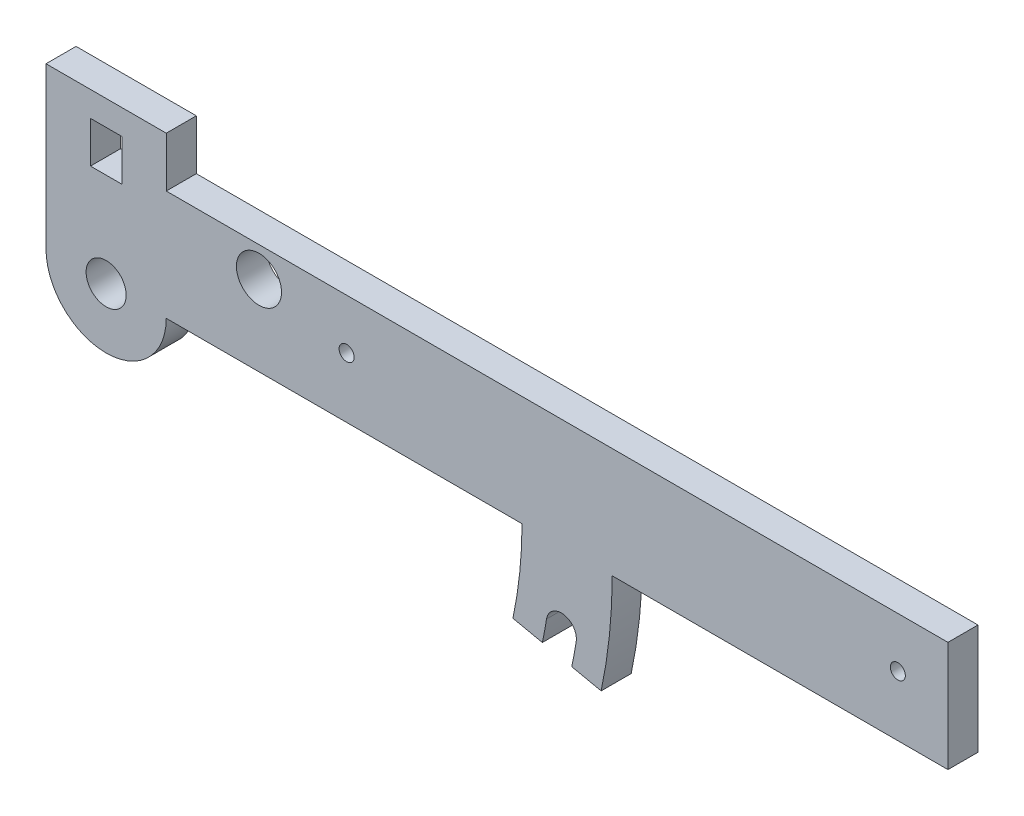
ISO-10303-21;
HEADER;
FILE_DESCRIPTION(('STEP AP214'),'2;1');
FILE_NAME('part.step','',(''),(''),'','','');
FILE_SCHEMA(('AUTOMOTIVE_DESIGN { 1 0 10303 214 1 1 1 1 }'));
ENDSEC;
DATA;
#1=APPLICATION_CONTEXT('core data for automotive mechanical design processes');
#2=APPLICATION_PROTOCOL_DEFINITION('international standard','automotive_design',2000,#1);
#3=PRODUCT_CONTEXT('',#1,'mechanical');
#4=PRODUCT('Part','Part','',(#3));
#5=PRODUCT_RELATED_PRODUCT_CATEGORY('part','',(#4));
#6=PRODUCT_DEFINITION_FORMATION('','',#4);
#7=PRODUCT_DEFINITION_CONTEXT('part definition',#1,'design');
#8=PRODUCT_DEFINITION('design','',#6,#7);
#9=PRODUCT_DEFINITION_SHAPE('','',#8);
#10=(LENGTH_UNIT() NAMED_UNIT(*) SI_UNIT(.MILLI.,.METRE.));
#11=(NAMED_UNIT(*) PLANE_ANGLE_UNIT() SI_UNIT($,.RADIAN.));
#12=(NAMED_UNIT(*) SI_UNIT($,.STERADIAN.) SOLID_ANGLE_UNIT());
#13=UNCERTAINTY_MEASURE_WITH_UNIT(LENGTH_MEASURE(1.E-05),#10,'distance_accuracy_value','');
#14=(GEOMETRIC_REPRESENTATION_CONTEXT(3) GLOBAL_UNCERTAINTY_ASSIGNED_CONTEXT((#13)) GLOBAL_UNIT_ASSIGNED_CONTEXT((#10,
#11,#12)) REPRESENTATION_CONTEXT('',''));
#15=CARTESIAN_POINT('',(0.,0.,0.));
#16=DIRECTION('',(0.,0.,1.));
#17=DIRECTION('',(1.,0.,0.));
#18=AXIS2_PLACEMENT_3D('',#15,#16,#17);
#19=CARTESIAN_POINT('',(-118.,-7.,6.));
#20=DIRECTION('',(0.,0.,1.));
#21=DIRECTION('',(1.,0.,0.));
#22=AXIS2_PLACEMENT_3D('',#19,#20,#21);
#23=PLANE('',#22);
#24=CARTESIAN_POINT('',(40.,5.,6.));
#25=DIRECTION('',(0.,0.,1.));
#26=DIRECTION('',(-1.,0.,0.));
#27=AXIS2_PLACEMENT_3D('',#24,#25,#26);
#28=CIRCLE('',#27,1.50000000000002);
#29=CARTESIAN_POINT('',(38.5,5.,6.));
#30=VERTEX_POINT('',#29);
#31=EDGE_CURVE('E193',#30,#30,#28,.T.);
#32=ORIENTED_EDGE('',*,*,#31,.F.);
#33=EDGE_LOOP('',(#32));
#34=FACE_BOUND('',#33,.T.);
#35=CARTESIAN_POINT('',(-118.,-7.,6.));
#36=DIRECTION('',(0.,0.,1.));
#37=DIRECTION('',(1.,0.,0.));
#38=AXIS2_PLACEMENT_3D('',#35,#36,#37);
#39=CIRCLE('',#38,4.00000000000001);
#40=CARTESIAN_POINT('',(-114.,-7.,6.));
#41=VERTEX_POINT('',#40);
#42=EDGE_CURVE('E209',#41,#41,#39,.T.);
#43=ORIENTED_EDGE('',*,*,#42,.F.);
#44=EDGE_LOOP('',(#43));
#45=FACE_BOUND('',#44,.T.);
#46=DIRECTION('',(-1.,0.,0.));
#47=VECTOR('',#46,1.);
#48=CARTESIAN_POINT('',(50.,15.,6.));
#49=LINE('',#48,#47);
#50=CARTESIAN_POINT('',(50.,15.,6.));
#51=VERTEX_POINT('',#50);
#52=CARTESIAN_POINT('',(-106.,15.,6.));
#53=VERTEX_POINT('',#52);
#54=EDGE_CURVE('E215',#51,#53,#49,.T.);
#55=ORIENTED_EDGE('',*,*,#54,.T.);
#56=DIRECTION('',(0.,1.,0.));
#57=VECTOR('',#56,1.);
#58=CARTESIAN_POINT('',(-106.,15.,6.));
#59=LINE('',#58,#57);
#60=CARTESIAN_POINT('',(-106.,25.,6.));
#61=VERTEX_POINT('',#60);
#62=EDGE_CURVE('E218',#53,#61,#59,.T.);
#63=ORIENTED_EDGE('',*,*,#62,.T.);
#64=DIRECTION('',(-1.,0.,0.));
#65=VECTOR('',#64,1.);
#66=CARTESIAN_POINT('',(-106.,25.,6.));
#67=LINE('',#66,#65);
#68=CARTESIAN_POINT('',(-130.,25.,6.));
#69=VERTEX_POINT('',#68);
#70=EDGE_CURVE('E221',#61,#69,#67,.T.);
#71=ORIENTED_EDGE('',*,*,#70,.T.);
#72=DIRECTION('',(0.,-1.,0.));
#73=VECTOR('',#72,1.);
#74=CARTESIAN_POINT('',(-130.,25.,6.));
#75=LINE('',#74,#73);
#76=CARTESIAN_POINT('',(-130.,-7.,6.));
#77=VERTEX_POINT('',#76);
#78=EDGE_CURVE('E223',#69,#77,#75,.T.);
#79=ORIENTED_EDGE('',*,*,#78,.T.);
#80=CARTESIAN_POINT('',(-118.,-7.,6.));
#81=DIRECTION('',(0.,0.,1.));
#82=DIRECTION('',(1.,0.,0.));
#83=AXIS2_PLACEMENT_3D('',#80,#81,#82);
#84=CIRCLE('',#83,12.);
#85=CARTESIAN_POINT('',(-106.,-7.,6.));
#86=VERTEX_POINT('',#85);
#87=EDGE_CURVE('E225',#77,#86,#84,.T.);
#88=ORIENTED_EDGE('',*,*,#87,.T.);
#89=DIRECTION('',(1.,0.,0.));
#90=VECTOR('',#89,1.);
#91=CARTESIAN_POINT('',(-106.,-7.,6.));
#92=LINE('',#91,#90);
#93=CARTESIAN_POINT('',(-35.,-6.99999999999999,6.));
#94=VERTEX_POINT('',#93);
#95=EDGE_CURVE('E227',#86,#94,#92,.T.);
#96=ORIENTED_EDGE('',*,*,#95,.T.);
#97=CARTESIAN_POINT('',(-118.,-7.,6.));
#98=DIRECTION('',(0.,0.,-1.));
#99=DIRECTION('',(-1.,0.,0.));
#100=AXIS2_PLACEMENT_3D('',#97,#98,#99);
#101=CIRCLE('',#100,83.);
#102=CARTESIAN_POINT('',(-36.8137491390941,-24.2566703378741,6.));
#103=VERTEX_POINT('',#102);
#104=EDGE_CURVE('E229',#94,#103,#101,.T.);
#105=ORIENTED_EDGE('',*,*,#104,.T.);
#106=DIRECTION('',(0.978147600733805,-0.20791169081776,0.));
#107=VECTOR('',#106,1.);
#108=CARTESIAN_POINT('',(-36.8137491390941,-24.2566703378741,6.));
#109=LINE('',#108,#107);
#110=CARTESIAN_POINT('',(-30.9448635346913,-25.5041404827806,6.));
#111=VERTEX_POINT('',#110);
#112=EDGE_CURVE('E231',#103,#111,#109,.T.);
#113=ORIENTED_EDGE('',*,*,#112,.T.);
#114=CARTESIAN_POINT('',(-118.,-7.,6.));
#115=DIRECTION('',(0.,0.,1.));
#116=DIRECTION('',(-1.,0.,0.));
#117=AXIS2_PLACEMENT_3D('',#114,#115,#116);
#118=CIRCLE('',#117,89.);
#119=CARTESIAN_POINT('',(-30.1123535870187,-21.0271739130435,6.));
#120=VERTEX_POINT('',#119);
#121=EDGE_CURVE('E233',#111,#120,#118,.T.);
#122=ORIENTED_EDGE('',*,*,#121,.T.);
#123=CARTESIAN_POINT('',(-27.1498486517496,-21.5,6.));
#124=DIRECTION('',(0.,0.,-1.));
#125=DIRECTION('',(-1.,0.,0.));
#126=AXIS2_PLACEMENT_3D('',#123,#124,#125);
#127=CIRCLE('',#126,3.);
#128=CARTESIAN_POINT('',(-24.1873437164806,-21.9728260869565,6.));
#129=VERTEX_POINT('',#128);
#130=EDGE_CURVE('E235',#120,#129,#127,.T.);
#131=ORIENTED_EDGE('',*,*,#130,.T.);
#132=CARTESIAN_POINT('',(-118.,-7.,6.));
#133=DIRECTION('',(0.,0.,-1.));
#134=DIRECTION('',(-1.,0.,0.));
#135=AXIS2_PLACEMENT_3D('',#132,#133,#134);
#136=CIRCLE('',#135,95.);
#137=CARTESIAN_POINT('',(-25.0759779302885,-26.7516106276872,6.));
#138=VERTEX_POINT('',#137);
#139=EDGE_CURVE('E237',#129,#138,#136,.T.);
#140=ORIENTED_EDGE('',*,*,#139,.T.);
#141=DIRECTION('',(0.978147600733806,-0.20791169081776,0.));
#142=VECTOR('',#141,1.);
#143=CARTESIAN_POINT('',(-25.0759779302885,-26.7516106276872,6.));
#144=LINE('',#143,#142);
#145=CARTESIAN_POINT('',(-19.2070923258856,-27.9990807725938,6.));
#146=VERTEX_POINT('',#145);
#147=EDGE_CURVE('E239',#138,#146,#144,.T.);
#148=ORIENTED_EDGE('',*,*,#147,.T.);
#149=CARTESIAN_POINT('',(-118.,-7.,6.));
#150=DIRECTION('',(0.,0.,1.));
#151=DIRECTION('',(-1.,0.,0.));
#152=AXIS2_PLACEMENT_3D('',#149,#150,#151);
#153=CIRCLE('',#152,101.);
#154=CARTESIAN_POINT('',(-17.,-7.00000000000002,6.));
#155=VERTEX_POINT('',#154);
#156=EDGE_CURVE('E241',#146,#155,#153,.T.);
#157=ORIENTED_EDGE('',*,*,#156,.T.);
#158=DIRECTION('',(1.,0.,0.));
#159=VECTOR('',#158,1.);
#160=CARTESIAN_POINT('',(-17.,-7.00000000000002,6.));
#161=LINE('',#160,#159);
#162=CARTESIAN_POINT('',(50.,-7.,6.));
#163=VERTEX_POINT('',#162);
#164=EDGE_CURVE('E243',#155,#163,#161,.T.);
#165=ORIENTED_EDGE('',*,*,#164,.T.);
#166=DIRECTION('',(0.,1.,0.));
#167=VECTOR('',#166,1.);
#168=CARTESIAN_POINT('',(50.,-7.,6.));
#169=LINE('',#168,#167);
#170=EDGE_CURVE('E245',#163,#51,#169,.T.);
#171=ORIENTED_EDGE('',*,*,#170,.T.);
#172=EDGE_LOOP('',(#55,#63,#71,#79,#88,#96,#105,#113,#122,#131,#140,#148,#157,#165,#171));
#173=FACE_BOUND('',#172,.T.);
#174=CARTESIAN_POINT('',(-87.5,9.,6.));
#175=DIRECTION('',(0.,0.,1.));
#176=DIRECTION('',(1.,0.,0.));
#177=AXIS2_PLACEMENT_3D('',#174,#175,#176);
#178=CIRCLE('',#177,4.5);
#179=CARTESIAN_POINT('',(-83.,9.,6.));
#180=VERTEX_POINT('',#179);
#181=EDGE_CURVE('E203',#180,#180,#178,.T.);
#182=ORIENTED_EDGE('',*,*,#181,.F.);
#183=EDGE_LOOP('',(#182));
#184=FACE_BOUND('',#183,.T.);
#185=DIRECTION('',(1.,0.,0.));
#186=VECTOR('',#185,1.);
#187=CARTESIAN_POINT('',(-121.125,11.75,6.));
#188=LINE('',#187,#186);
#189=CARTESIAN_POINT('',(-121.125,11.75,6.));
#190=VERTEX_POINT('',#189);
#191=CARTESIAN_POINT('',(-114.875,11.75,6.));
#192=VERTEX_POINT('',#191);
#193=EDGE_CURVE('E172',#190,#192,#188,.T.);
#194=ORIENTED_EDGE('',*,*,#193,.F.);
#195=DIRECTION('',(0.,-1.,0.));
#196=VECTOR('',#195,1.);
#197=CARTESIAN_POINT('',(-121.125,20.,6.));
#198=LINE('',#197,#196);
#199=CARTESIAN_POINT('',(-121.125,20.,6.));
#200=VERTEX_POINT('',#199);
#201=EDGE_CURVE('E164',#200,#190,#198,.T.);
#202=ORIENTED_EDGE('',*,*,#201,.F.);
#203=DIRECTION('',(-1.,0.,0.));
#204=VECTOR('',#203,1.);
#205=CARTESIAN_POINT('',(-121.125,20.,6.));
#206=LINE('',#205,#204);
#207=CARTESIAN_POINT('',(-114.875,20.,6.));
#208=VERTEX_POINT('',#207);
#209=EDGE_CURVE('E187',#208,#200,#206,.T.);
#210=ORIENTED_EDGE('',*,*,#209,.F.);
#211=DIRECTION('',(0.,1.,0.));
#212=VECTOR('',#211,1.);
#213=CARTESIAN_POINT('',(-114.875,20.,6.));
#214=LINE('',#213,#212);
#215=EDGE_CURVE('E185',#192,#208,#214,.T.);
#216=ORIENTED_EDGE('',*,*,#215,.F.);
#217=EDGE_LOOP('',(#194,#202,#210,#216));
#218=FACE_BOUND('',#217,.T.);
#219=CARTESIAN_POINT('',(-70.,5.,6.));
#220=DIRECTION('',(0.,0.,1.));
#221=DIRECTION('',(1.,0.,0.));
#222=AXIS2_PLACEMENT_3D('',#219,#220,#221);
#223=CIRCLE('',#222,1.5);
#224=CARTESIAN_POINT('',(-68.5,5.,6.));
#225=VERTEX_POINT('',#224);
#226=EDGE_CURVE('E608',#225,#225,#223,.T.);
#227=ORIENTED_EDGE('',*,*,#226,.F.);
#228=EDGE_LOOP('',(#227));
#229=FACE_BOUND('',#228,.T.);
#230=ADVANCED_FACE('F33',(#34,#45,#173,#184,#218,#229),#23,.T.);
#231=CARTESIAN_POINT('',(-118.,-7.,0.));
#232=DIRECTION('',(0.,0.,1.));
#233=DIRECTION('',(1.,0.,0.));
#234=AXIS2_PLACEMENT_3D('',#231,#232,#233);
#235=PLANE('',#234);
#236=CARTESIAN_POINT('',(-87.5,9.,0.));
#237=DIRECTION('',(0.,0.,1.));
#238=DIRECTION('',(1.,0.,0.));
#239=AXIS2_PLACEMENT_3D('',#236,#237,#238);
#240=CIRCLE('',#239,4.5);
#241=CARTESIAN_POINT('',(-83.,9.,0.));
#242=VERTEX_POINT('',#241);
#243=EDGE_CURVE('E180',#242,#242,#240,.T.);
#244=ORIENTED_EDGE('',*,*,#243,.T.);
#245=EDGE_LOOP('',(#244));
#246=FACE_BOUND('',#245,.T.);
#247=CARTESIAN_POINT('',(-118.,-7.,0.));
#248=DIRECTION('',(0.,0.,1.));
#249=DIRECTION('',(1.,0.,0.));
#250=AXIS2_PLACEMENT_3D('',#247,#248,#249);
#251=CIRCLE('',#250,4.00000000000001);
#252=CARTESIAN_POINT('',(-114.,-7.,0.));
#253=VERTEX_POINT('',#252);
#254=EDGE_CURVE('E206',#253,#253,#251,.T.);
#255=ORIENTED_EDGE('',*,*,#254,.T.);
#256=EDGE_LOOP('',(#255));
#257=FACE_BOUND('',#256,.T.);
#258=DIRECTION('',(-1.,0.,0.));
#259=VECTOR('',#258,1.);
#260=CARTESIAN_POINT('',(50.,15.,0.));
#261=LINE('',#260,#259);
#262=CARTESIAN_POINT('',(50.,15.,0.));
#263=VERTEX_POINT('',#262);
#264=CARTESIAN_POINT('',(-106.,15.,0.));
#265=VERTEX_POINT('',#264);
#266=EDGE_CURVE('E212',#263,#265,#261,.T.);
#267=ORIENTED_EDGE('',*,*,#266,.F.);
#268=DIRECTION('',(0.,1.,0.));
#269=VECTOR('',#268,1.);
#270=CARTESIAN_POINT('',(50.,-7.,0.));
#271=LINE('',#270,#269);
#272=CARTESIAN_POINT('',(50.,-7.,0.));
#273=VERTEX_POINT('',#272);
#274=EDGE_CURVE('E219',#273,#263,#271,.T.);
#275=ORIENTED_EDGE('',*,*,#274,.F.);
#276=DIRECTION('',(1.,0.,0.));
#277=VECTOR('',#276,1.);
#278=CARTESIAN_POINT('',(-17.,-7.00000000000002,0.));
#279=LINE('',#278,#277);
#280=CARTESIAN_POINT('',(-17.,-7.00000000000002,0.));
#281=VERTEX_POINT('',#280);
#282=EDGE_CURVE('E274',#281,#273,#279,.T.);
#283=ORIENTED_EDGE('',*,*,#282,.F.);
#284=CARTESIAN_POINT('',(-118.,-7.,0.));
#285=DIRECTION('',(0.,0.,1.));
#286=DIRECTION('',(-1.,0.,0.));
#287=AXIS2_PLACEMENT_3D('',#284,#285,#286);
#288=CIRCLE('',#287,101.);
#289=CARTESIAN_POINT('',(-19.2070923258856,-27.9990807725938,0.));
#290=VERTEX_POINT('',#289);
#291=EDGE_CURVE('E272',#290,#281,#288,.T.);
#292=ORIENTED_EDGE('',*,*,#291,.F.);
#293=DIRECTION('',(0.978147600733806,-0.20791169081776,0.));
#294=VECTOR('',#293,1.);
#295=CARTESIAN_POINT('',(-25.0759779302885,-26.7516106276872,0.));
#296=LINE('',#295,#294);
#297=CARTESIAN_POINT('',(-25.0759779302885,-26.7516106276872,0.));
#298=VERTEX_POINT('',#297);
#299=EDGE_CURVE('E270',#298,#290,#296,.T.);
#300=ORIENTED_EDGE('',*,*,#299,.F.);
#301=CARTESIAN_POINT('',(-118.,-7.,0.));
#302=DIRECTION('',(0.,0.,-1.));
#303=DIRECTION('',(-1.,0.,0.));
#304=AXIS2_PLACEMENT_3D('',#301,#302,#303);
#305=CIRCLE('',#304,95.);
#306=CARTESIAN_POINT('',(-24.1873437164806,-21.9728260869565,0.));
#307=VERTEX_POINT('',#306);
#308=EDGE_CURVE('E268',#307,#298,#305,.T.);
#309=ORIENTED_EDGE('',*,*,#308,.F.);
#310=CARTESIAN_POINT('',(-27.1498486517496,-21.5,0.));
#311=DIRECTION('',(0.,0.,-1.));
#312=DIRECTION('',(-1.,0.,0.));
#313=AXIS2_PLACEMENT_3D('',#310,#311,#312);
#314=CIRCLE('',#313,3.);
#315=CARTESIAN_POINT('',(-30.1123535870187,-21.0271739130435,0.));
#316=VERTEX_POINT('',#315);
#317=EDGE_CURVE('E266',#316,#307,#314,.T.);
#318=ORIENTED_EDGE('',*,*,#317,.F.);
#319=CARTESIAN_POINT('',(-118.,-7.,0.));
#320=DIRECTION('',(0.,0.,1.));
#321=DIRECTION('',(-1.,0.,0.));
#322=AXIS2_PLACEMENT_3D('',#319,#320,#321);
#323=CIRCLE('',#322,89.);
#324=CARTESIAN_POINT('',(-30.9448635346913,-25.5041404827806,0.));
#325=VERTEX_POINT('',#324);
#326=EDGE_CURVE('E264',#325,#316,#323,.T.);
#327=ORIENTED_EDGE('',*,*,#326,.F.);
#328=DIRECTION('',(0.978147600733805,-0.20791169081776,0.));
#329=VECTOR('',#328,1.);
#330=CARTESIAN_POINT('',(-36.8137491390941,-24.2566703378741,0.));
#331=LINE('',#330,#329);
#332=CARTESIAN_POINT('',(-36.8137491390941,-24.2566703378741,0.));
#333=VERTEX_POINT('',#332);
#334=EDGE_CURVE('E262',#333,#325,#331,.T.);
#335=ORIENTED_EDGE('',*,*,#334,.F.);
#336=CARTESIAN_POINT('',(-118.,-7.,0.));
#337=DIRECTION('',(0.,0.,-1.));
#338=DIRECTION('',(-1.,0.,0.));
#339=AXIS2_PLACEMENT_3D('',#336,#337,#338);
#340=CIRCLE('',#339,83.);
#341=CARTESIAN_POINT('',(-35.,-6.99999999999999,0.));
#342=VERTEX_POINT('',#341);
#343=EDGE_CURVE('E260',#342,#333,#340,.T.);
#344=ORIENTED_EDGE('',*,*,#343,.F.);
#345=DIRECTION('',(1.,0.,0.));
#346=VECTOR('',#345,1.);
#347=CARTESIAN_POINT('',(-106.,-7.,0.));
#348=LINE('',#347,#346);
#349=CARTESIAN_POINT('',(-106.,-7.,0.));
#350=VERTEX_POINT('',#349);
#351=EDGE_CURVE('E258',#350,#342,#348,.T.);
#352=ORIENTED_EDGE('',*,*,#351,.F.);
#353=CARTESIAN_POINT('',(-118.,-7.,0.));
#354=DIRECTION('',(0.,0.,1.));
#355=DIRECTION('',(1.,0.,0.));
#356=AXIS2_PLACEMENT_3D('',#353,#354,#355);
#357=CIRCLE('',#356,12.);
#358=CARTESIAN_POINT('',(-130.,-7.,0.));
#359=VERTEX_POINT('',#358);
#360=EDGE_CURVE('E256',#359,#350,#357,.T.);
#361=ORIENTED_EDGE('',*,*,#360,.F.);
#362=DIRECTION('',(0.,-1.,0.));
#363=VECTOR('',#362,1.);
#364=CARTESIAN_POINT('',(-130.,25.,0.));
#365=LINE('',#364,#363);
#366=CARTESIAN_POINT('',(-130.,25.,0.));
#367=VERTEX_POINT('',#366);
#368=EDGE_CURVE('E254',#367,#359,#365,.T.);
#369=ORIENTED_EDGE('',*,*,#368,.F.);
#370=DIRECTION('',(-1.,0.,0.));
#371=VECTOR('',#370,1.);
#372=CARTESIAN_POINT('',(-106.,25.,0.));
#373=LINE('',#372,#371);
#374=CARTESIAN_POINT('',(-106.,25.,0.));
#375=VERTEX_POINT('',#374);
#376=EDGE_CURVE('E252',#375,#367,#373,.T.);
#377=ORIENTED_EDGE('',*,*,#376,.F.);
#378=DIRECTION('',(0.,1.,0.));
#379=VECTOR('',#378,1.);
#380=CARTESIAN_POINT('',(-106.,15.,0.));
#381=LINE('',#380,#379);
#382=EDGE_CURVE('E250',#265,#375,#381,.T.);
#383=ORIENTED_EDGE('',*,*,#382,.F.);
#384=EDGE_LOOP('',(#267,#275,#283,#292,#300,#309,#318,#327,#335,#344,#352,#361,#369,#377,#383));
#385=FACE_BOUND('',#384,.T.);
#386=DIRECTION('',(0.,-1.,0.));
#387=VECTOR('',#386,1.);
#388=CARTESIAN_POINT('',(-121.125,20.,0.));
#389=LINE('',#388,#387);
#390=CARTESIAN_POINT('',(-121.125,20.,0.));
#391=VERTEX_POINT('',#390);
#392=CARTESIAN_POINT('',(-121.125,11.75,0.));
#393=VERTEX_POINT('',#392);
#394=EDGE_CURVE('E56',#391,#393,#389,.T.);
#395=ORIENTED_EDGE('',*,*,#394,.T.);
#396=DIRECTION('',(1.,0.,0.));
#397=VECTOR('',#396,1.);
#398=CARTESIAN_POINT('',(-121.125,11.75,0.));
#399=LINE('',#398,#397);
#400=CARTESIAN_POINT('',(-114.875,11.75,0.));
#401=VERTEX_POINT('',#400);
#402=EDGE_CURVE('E179',#393,#401,#399,.T.);
#403=ORIENTED_EDGE('',*,*,#402,.T.);
#404=DIRECTION('',(0.,1.,0.));
#405=VECTOR('',#404,1.);
#406=CARTESIAN_POINT('',(-114.875,20.,0.));
#407=LINE('',#406,#405);
#408=CARTESIAN_POINT('',(-114.875,20.,0.));
#409=VERTEX_POINT('',#408);
#410=EDGE_CURVE('E195',#401,#409,#407,.T.);
#411=ORIENTED_EDGE('',*,*,#410,.T.);
#412=DIRECTION('',(-1.,0.,0.));
#413=VECTOR('',#412,1.);
#414=CARTESIAN_POINT('',(-121.125,20.,0.));
#415=LINE('',#414,#413);
#416=EDGE_CURVE('E173',#409,#391,#415,.T.);
#417=ORIENTED_EDGE('',*,*,#416,.T.);
#418=EDGE_LOOP('',(#395,#403,#411,#417));
#419=FACE_BOUND('',#418,.T.);
#420=CARTESIAN_POINT('',(40.,5.,0.));
#421=DIRECTION('',(0.,0.,1.));
#422=DIRECTION('',(-1.,0.,0.));
#423=AXIS2_PLACEMENT_3D('',#420,#421,#422);
#424=CIRCLE('',#423,1.50000000000002);
#425=CARTESIAN_POINT('',(38.5,5.,0.));
#426=VERTEX_POINT('',#425);
#427=EDGE_CURVE('E614',#426,#426,#424,.T.);
#428=ORIENTED_EDGE('',*,*,#427,.T.);
#429=EDGE_LOOP('',(#428));
#430=FACE_BOUND('',#429,.T.);
#431=CARTESIAN_POINT('',(-70.,5.,0.));
#432=DIRECTION('',(0.,0.,1.));
#433=DIRECTION('',(1.,0.,0.));
#434=AXIS2_PLACEMENT_3D('',#431,#432,#433);
#435=CIRCLE('',#434,1.5);
#436=CARTESIAN_POINT('',(-68.5,5.,0.));
#437=VERTEX_POINT('',#436);
#438=EDGE_CURVE('E611',#437,#437,#435,.T.);
#439=ORIENTED_EDGE('',*,*,#438,.T.);
#440=EDGE_LOOP('',(#439));
#441=FACE_BOUND('',#440,.T.);
#442=ADVANCED_FACE('F325',(#246,#257,#385,#419,#430,#441),#235,.F.);
#443=CARTESIAN_POINT('',(50.,15.,6.));
#444=DIRECTION('',(0.,-1.,0.));
#445=DIRECTION('',(1.,0.,0.));
#446=AXIS2_PLACEMENT_3D('',#443,#444,#445);
#447=PLANE('',#446);
#448=ORIENTED_EDGE('',*,*,#266,.T.);
#449=DIRECTION('',(0.,0.,-1.));
#450=VECTOR('',#449,1.);
#451=CARTESIAN_POINT('',(-106.,15.,6.));
#452=LINE('',#451,#450);
#453=EDGE_CURVE('E11',#53,#265,#452,.T.);
#454=ORIENTED_EDGE('',*,*,#453,.F.);
#455=ORIENTED_EDGE('',*,*,#54,.F.);
#456=DIRECTION('',(0.,0.,-1.));
#457=VECTOR('',#456,1.);
#458=CARTESIAN_POINT('',(50.,15.,6.));
#459=LINE('',#458,#457);
#460=EDGE_CURVE('E247',#51,#263,#459,.T.);
#461=ORIENTED_EDGE('',*,*,#460,.T.);
#462=EDGE_LOOP('',(#448,#454,#455,#461));
#463=FACE_BOUND('',#462,.T.);
#464=ADVANCED_FACE('F35',(#463),#447,.F.);
#465=CARTESIAN_POINT('',(-106.,15.,6.));
#466=DIRECTION('',(-1.,0.,0.));
#467=DIRECTION('',(0.,-1.,0.));
#468=AXIS2_PLACEMENT_3D('',#465,#466,#467);
#469=PLANE('',#468);
#470=ORIENTED_EDGE('',*,*,#382,.T.);
#471=DIRECTION('',(0.,0.,-1.));
#472=VECTOR('',#471,1.);
#473=CARTESIAN_POINT('',(-106.,25.,6.));
#474=LINE('',#473,#472);
#475=EDGE_CURVE('E41',#61,#375,#474,.T.);
#476=ORIENTED_EDGE('',*,*,#475,.F.);
#477=ORIENTED_EDGE('',*,*,#62,.F.);
#478=ORIENTED_EDGE('',*,*,#453,.T.);
#479=EDGE_LOOP('',(#470,#476,#477,#478));
#480=FACE_BOUND('',#479,.T.);
#481=ADVANCED_FACE('F343',(#480),#469,.F.);
#482=CARTESIAN_POINT('',(-106.,25.,6.));
#483=DIRECTION('',(0.,-1.,0.));
#484=DIRECTION('',(1.,0.,0.));
#485=AXIS2_PLACEMENT_3D('',#482,#483,#484);
#486=PLANE('',#485);
#487=ORIENTED_EDGE('',*,*,#376,.T.);
#488=DIRECTION('',(0.,0.,-1.));
#489=VECTOR('',#488,1.);
#490=CARTESIAN_POINT('',(-130.,25.,6.));
#491=LINE('',#490,#489);
#492=EDGE_CURVE('E312',#69,#367,#491,.T.);
#493=ORIENTED_EDGE('',*,*,#492,.F.);
#494=ORIENTED_EDGE('',*,*,#70,.F.);
#495=ORIENTED_EDGE('',*,*,#475,.T.);
#496=EDGE_LOOP('',(#487,#493,#494,#495));
#497=FACE_BOUND('',#496,.T.);
#498=ADVANCED_FACE('F319',(#497),#486,.F.);
#499=CARTESIAN_POINT('',(-130.,25.,6.));
#500=DIRECTION('',(1.,0.,0.));
#501=DIRECTION('',(0.,1.,0.));
#502=AXIS2_PLACEMENT_3D('',#499,#500,#501);
#503=PLANE('',#502);
#504=ORIENTED_EDGE('',*,*,#368,.T.);
#505=DIRECTION('',(0.,0.,-1.));
#506=VECTOR('',#505,1.);
#507=CARTESIAN_POINT('',(-130.,-7.,6.));
#508=LINE('',#507,#506);
#509=EDGE_CURVE('E309',#77,#359,#508,.T.);
#510=ORIENTED_EDGE('',*,*,#509,.F.);
#511=ORIENTED_EDGE('',*,*,#78,.F.);
#512=ORIENTED_EDGE('',*,*,#492,.T.);
#513=EDGE_LOOP('',(#504,#510,#511,#512));
#514=FACE_BOUND('',#513,.T.);
#515=ADVANCED_FACE('F331',(#514),#503,.F.);
#516=CARTESIAN_POINT('',(-118.,-7.,6.));
#517=DIRECTION('',(0.,0.,-1.));
#518=DIRECTION('',(-1.,0.,0.));
#519=AXIS2_PLACEMENT_3D('',#516,#517,#518);
#520=CYLINDRICAL_SURFACE('',#519,12.);
#521=ORIENTED_EDGE('',*,*,#360,.T.);
#522=DIRECTION('',(0.,0.,-1.));
#523=VECTOR('',#522,1.);
#524=CARTESIAN_POINT('',(-106.,-7.,6.));
#525=LINE('',#524,#523);
#526=EDGE_CURVE('E306',#86,#350,#525,.T.);
#527=ORIENTED_EDGE('',*,*,#526,.F.);
#528=ORIENTED_EDGE('',*,*,#87,.F.);
#529=ORIENTED_EDGE('',*,*,#509,.T.);
#530=EDGE_LOOP('',(#521,#527,#528,#529));
#531=FACE_BOUND('',#530,.T.);
#532=ADVANCED_FACE('F335',(#531),#520,.T.);
#533=CARTESIAN_POINT('',(-106.,-7.,6.));
#534=DIRECTION('',(0.,1.,0.));
#535=DIRECTION('',(-1.,0.,0.));
#536=AXIS2_PLACEMENT_3D('',#533,#534,#535);
#537=PLANE('',#536);
#538=ORIENTED_EDGE('',*,*,#351,.T.);
#539=DIRECTION('',(0.,0.,-1.));
#540=VECTOR('',#539,1.);
#541=CARTESIAN_POINT('',(-35.,-6.99999999999999,6.));
#542=LINE('',#541,#540);
#543=EDGE_CURVE('E303',#94,#342,#542,.T.);
#544=ORIENTED_EDGE('',*,*,#543,.F.);
#545=ORIENTED_EDGE('',*,*,#95,.F.);
#546=ORIENTED_EDGE('',*,*,#526,.T.);
#547=EDGE_LOOP('',(#538,#544,#545,#546));
#548=FACE_BOUND('',#547,.T.);
#549=ADVANCED_FACE('F391',(#548),#537,.F.);
#550=CARTESIAN_POINT('',(-118.,-7.,6.));
#551=DIRECTION('',(0.,0.,-1.));
#552=DIRECTION('',(-1.,0.,0.));
#553=AXIS2_PLACEMENT_3D('',#550,#551,#552);
#554=CYLINDRICAL_SURFACE('',#553,83.);
#555=ORIENTED_EDGE('',*,*,#343,.T.);
#556=DIRECTION('',(0.,0.,-1.));
#557=VECTOR('',#556,1.);
#558=CARTESIAN_POINT('',(-36.8137491390941,-24.2566703378741,6.));
#559=LINE('',#558,#557);
#560=EDGE_CURVE('E300',#103,#333,#559,.T.);
#561=ORIENTED_EDGE('',*,*,#560,.F.);
#562=ORIENTED_EDGE('',*,*,#104,.F.);
#563=ORIENTED_EDGE('',*,*,#543,.T.);
#564=EDGE_LOOP('',(#555,#561,#562,#563));
#565=FACE_BOUND('',#564,.T.);
#566=ADVANCED_FACE('F389',(#565),#554,.F.);
#567=CARTESIAN_POINT('',(-36.8137491390941,-24.2566703378741,6.));
#568=DIRECTION('',(0.20791169081776,0.978147600733805,0.));
#569=DIRECTION('',(-0.978147600733806,0.20791169081776,0.));
#570=AXIS2_PLACEMENT_3D('',#567,#568,#569);
#571=PLANE('',#570);
#572=ORIENTED_EDGE('',*,*,#334,.T.);
#573=DIRECTION('',(0.,0.,-1.));
#574=VECTOR('',#573,1.);
#575=CARTESIAN_POINT('',(-30.9448635346913,-25.5041404827806,6.));
#576=LINE('',#575,#574);
#577=EDGE_CURVE('E297',#111,#325,#576,.T.);
#578=ORIENTED_EDGE('',*,*,#577,.F.);
#579=ORIENTED_EDGE('',*,*,#112,.F.);
#580=ORIENTED_EDGE('',*,*,#560,.T.);
#581=EDGE_LOOP('',(#572,#578,#579,#580));
#582=FACE_BOUND('',#581,.T.);
#583=ADVANCED_FACE('F385',(#582),#571,.F.);
#584=CARTESIAN_POINT('',(-118.,-7.,6.));
#585=DIRECTION('',(0.,0.,-1.));
#586=DIRECTION('',(-1.,0.,0.));
#587=AXIS2_PLACEMENT_3D('',#584,#585,#586);
#588=CYLINDRICAL_SURFACE('',#587,89.);
#589=ORIENTED_EDGE('',*,*,#326,.T.);
#590=DIRECTION('',(0.,0.,-1.));
#591=VECTOR('',#590,1.);
#592=CARTESIAN_POINT('',(-30.1123535870187,-21.0271739130435,6.));
#593=LINE('',#592,#591);
#594=EDGE_CURVE('E294',#120,#316,#593,.T.);
#595=ORIENTED_EDGE('',*,*,#594,.F.);
#596=ORIENTED_EDGE('',*,*,#121,.F.);
#597=ORIENTED_EDGE('',*,*,#577,.T.);
#598=EDGE_LOOP('',(#589,#595,#596,#597));
#599=FACE_BOUND('',#598,.T.);
#600=ADVANCED_FACE('F380',(#599),#588,.T.);
#601=CARTESIAN_POINT('',(-27.1498486517496,-21.5,6.));
#602=DIRECTION('',(0.,0.,-1.));
#603=DIRECTION('',(-1.,0.,0.));
#604=AXIS2_PLACEMENT_3D('',#601,#602,#603);
#605=CYLINDRICAL_SURFACE('',#604,3.);
#606=ORIENTED_EDGE('',*,*,#317,.T.);
#607=DIRECTION('',(0.,0.,-1.));
#608=VECTOR('',#607,1.);
#609=CARTESIAN_POINT('',(-24.1873437164806,-21.9728260869565,6.));
#610=LINE('',#609,#608);
#611=EDGE_CURVE('E291',#129,#307,#610,.T.);
#612=ORIENTED_EDGE('',*,*,#611,.F.);
#613=ORIENTED_EDGE('',*,*,#130,.F.);
#614=ORIENTED_EDGE('',*,*,#594,.T.);
#615=EDGE_LOOP('',(#606,#612,#613,#614));
#616=FACE_BOUND('',#615,.T.);
#617=ADVANCED_FACE('F374',(#616),#605,.F.);
#618=CARTESIAN_POINT('',(-118.,-7.,6.));
#619=DIRECTION('',(0.,0.,-1.));
#620=DIRECTION('',(-1.,0.,0.));
#621=AXIS2_PLACEMENT_3D('',#618,#619,#620);
#622=CYLINDRICAL_SURFACE('',#621,95.);
#623=ORIENTED_EDGE('',*,*,#308,.T.);
#624=DIRECTION('',(0.,0.,-1.));
#625=VECTOR('',#624,1.);
#626=CARTESIAN_POINT('',(-25.0759779302885,-26.7516106276872,6.));
#627=LINE('',#626,#625);
#628=EDGE_CURVE('E288',#138,#298,#627,.T.);
#629=ORIENTED_EDGE('',*,*,#628,.F.);
#630=ORIENTED_EDGE('',*,*,#139,.F.);
#631=ORIENTED_EDGE('',*,*,#611,.T.);
#632=EDGE_LOOP('',(#623,#629,#630,#631));
#633=FACE_BOUND('',#632,.T.);
#634=ADVANCED_FACE('F370',(#633),#622,.F.);
#635=CARTESIAN_POINT('',(-25.0759779302885,-26.7516106276872,6.));
#636=DIRECTION('',(0.20791169081776,0.978147600733805,0.));
#637=DIRECTION('',(-0.978147600733806,0.20791169081776,0.));
#638=AXIS2_PLACEMENT_3D('',#635,#636,#637);
#639=PLANE('',#638);
#640=ORIENTED_EDGE('',*,*,#299,.T.);
#641=DIRECTION('',(0.,0.,-1.));
#642=VECTOR('',#641,1.);
#643=CARTESIAN_POINT('',(-19.2070923258856,-27.9990807725938,6.));
#644=LINE('',#643,#642);
#645=EDGE_CURVE('E285',#146,#290,#644,.T.);
#646=ORIENTED_EDGE('',*,*,#645,.F.);
#647=ORIENTED_EDGE('',*,*,#147,.F.);
#648=ORIENTED_EDGE('',*,*,#628,.T.);
#649=EDGE_LOOP('',(#640,#646,#647,#648));
#650=FACE_BOUND('',#649,.T.);
#651=ADVANCED_FACE('F365',(#650),#639,.F.);
#652=CARTESIAN_POINT('',(-118.,-7.,6.));
#653=DIRECTION('',(0.,0.,-1.));
#654=DIRECTION('',(-1.,0.,0.));
#655=AXIS2_PLACEMENT_3D('',#652,#653,#654);
#656=CYLINDRICAL_SURFACE('',#655,101.);
#657=ORIENTED_EDGE('',*,*,#291,.T.);
#658=DIRECTION('',(0.,0.,-1.));
#659=VECTOR('',#658,1.);
#660=CARTESIAN_POINT('',(-17.,-7.00000000000002,6.));
#661=LINE('',#660,#659);
#662=EDGE_CURVE('E282',#155,#281,#661,.T.);
#663=ORIENTED_EDGE('',*,*,#662,.F.);
#664=ORIENTED_EDGE('',*,*,#156,.F.);
#665=ORIENTED_EDGE('',*,*,#645,.T.);
#666=EDGE_LOOP('',(#657,#663,#664,#665));
#667=FACE_BOUND('',#666,.T.);
#668=ADVANCED_FACE('F359',(#667),#656,.T.);
#669=CARTESIAN_POINT('',(-17.,-7.00000000000002,6.));
#670=DIRECTION('',(0.,1.,0.));
#671=DIRECTION('',(-1.,0.,0.));
#672=AXIS2_PLACEMENT_3D('',#669,#670,#671);
#673=PLANE('',#672);
#674=ORIENTED_EDGE('',*,*,#282,.T.);
#675=DIRECTION('',(0.,0.,-1.));
#676=VECTOR('',#675,1.);
#677=CARTESIAN_POINT('',(50.,-7.,6.));
#678=LINE('',#677,#676);
#679=EDGE_CURVE('E279',#163,#273,#678,.T.);
#680=ORIENTED_EDGE('',*,*,#679,.F.);
#681=ORIENTED_EDGE('',*,*,#164,.F.);
#682=ORIENTED_EDGE('',*,*,#662,.T.);
#683=EDGE_LOOP('',(#674,#680,#681,#682));
#684=FACE_BOUND('',#683,.T.);
#685=ADVANCED_FACE('F355',(#684),#673,.F.);
#686=CARTESIAN_POINT('',(50.,-7.,6.));
#687=DIRECTION('',(-1.,0.,0.));
#688=DIRECTION('',(0.,0.,1.));
#689=AXIS2_PLACEMENT_3D('',#686,#687,#688);
#690=PLANE('',#689);
#691=ORIENTED_EDGE('',*,*,#274,.T.);
#692=ORIENTED_EDGE('',*,*,#460,.F.);
#693=ORIENTED_EDGE('',*,*,#170,.F.);
#694=ORIENTED_EDGE('',*,*,#679,.T.);
#695=EDGE_LOOP('',(#691,#692,#693,#694));
#696=FACE_BOUND('',#695,.T.);
#697=ADVANCED_FACE('F350',(#696),#690,.F.);
#698=CARTESIAN_POINT('',(-118.,-7.,6.));
#699=DIRECTION('',(0.,0.,-1.));
#700=DIRECTION('',(-1.,0.,0.));
#701=AXIS2_PLACEMENT_3D('',#698,#699,#700);
#702=CYLINDRICAL_SURFACE('',#701,4.00000000000001);
#703=ORIENTED_EDGE('',*,*,#42,.T.);
#704=EDGE_LOOP('',(#703));
#705=FACE_BOUND('',#704,.T.);
#706=ORIENTED_EDGE('',*,*,#254,.F.);
#707=EDGE_LOOP('',(#706));
#708=FACE_BOUND('',#707,.T.);
#709=ADVANCED_FACE('F411',(#705,#708),#702,.F.);
#710=CARTESIAN_POINT('',(-87.5,9.,6.));
#711=DIRECTION('',(0.,0.,-1.));
#712=DIRECTION('',(-1.,0.,0.));
#713=AXIS2_PLACEMENT_3D('',#710,#711,#712);
#714=CYLINDRICAL_SURFACE('',#713,4.5);
#715=ORIENTED_EDGE('',*,*,#181,.T.);
#716=EDGE_LOOP('',(#715));
#717=FACE_BOUND('',#716,.T.);
#718=ORIENTED_EDGE('',*,*,#243,.F.);
#719=EDGE_LOOP('',(#718));
#720=FACE_BOUND('',#719,.T.);
#721=ADVANCED_FACE('F467',(#717,#720),#714,.F.);
#722=CARTESIAN_POINT('',(-121.125,20.,6.));
#723=DIRECTION('',(1.,0.,0.));
#724=DIRECTION('',(0.,0.,-1.));
#725=AXIS2_PLACEMENT_3D('',#722,#723,#724);
#726=PLANE('',#725);
#727=ORIENTED_EDGE('',*,*,#394,.F.);
#728=DIRECTION('',(0.,0.,-1.));
#729=VECTOR('',#728,1.);
#730=CARTESIAN_POINT('',(-121.125,20.,6.));
#731=LINE('',#730,#729);
#732=EDGE_CURVE('E168',#200,#391,#731,.T.);
#733=ORIENTED_EDGE('',*,*,#732,.F.);
#734=ORIENTED_EDGE('',*,*,#201,.T.);
#735=DIRECTION('',(0.,0.,-1.));
#736=VECTOR('',#735,1.);
#737=CARTESIAN_POINT('',(-121.125,11.75,6.));
#738=LINE('',#737,#736);
#739=EDGE_CURVE('E167',#190,#393,#738,.T.);
#740=ORIENTED_EDGE('',*,*,#739,.T.);
#741=EDGE_LOOP('',(#727,#733,#734,#740));
#742=FACE_BOUND('',#741,.T.);
#743=ADVANCED_FACE('F166',(#742),#726,.T.);
#744=CARTESIAN_POINT('',(-121.125,11.75,6.));
#745=DIRECTION('',(0.,1.,0.));
#746=DIRECTION('',(0.,0.,1.));
#747=AXIS2_PLACEMENT_3D('',#744,#745,#746);
#748=PLANE('',#747);
#749=ORIENTED_EDGE('',*,*,#402,.F.);
#750=ORIENTED_EDGE('',*,*,#739,.F.);
#751=ORIENTED_EDGE('',*,*,#193,.T.);
#752=DIRECTION('',(0.,0.,-1.));
#753=VECTOR('',#752,1.);
#754=CARTESIAN_POINT('',(-114.875,11.75,6.));
#755=LINE('',#754,#753);
#756=EDGE_CURVE('E181',#192,#401,#755,.T.);
#757=ORIENTED_EDGE('',*,*,#756,.T.);
#758=EDGE_LOOP('',(#749,#750,#751,#757));
#759=FACE_BOUND('',#758,.T.);
#760=ADVANCED_FACE('F176',(#759),#748,.T.);
#761=CARTESIAN_POINT('',(-114.875,20.,6.));
#762=DIRECTION('',(-1.,0.,0.));
#763=DIRECTION('',(0.,0.,1.));
#764=AXIS2_PLACEMENT_3D('',#761,#762,#763);
#765=PLANE('',#764);
#766=ORIENTED_EDGE('',*,*,#410,.F.);
#767=ORIENTED_EDGE('',*,*,#756,.F.);
#768=ORIENTED_EDGE('',*,*,#215,.T.);
#769=DIRECTION('',(0.,0.,-1.));
#770=VECTOR('',#769,1.);
#771=CARTESIAN_POINT('',(-114.875,20.,6.));
#772=LINE('',#771,#770);
#773=EDGE_CURVE('E48',#208,#409,#772,.T.);
#774=ORIENTED_EDGE('',*,*,#773,.T.);
#775=EDGE_LOOP('',(#766,#767,#768,#774));
#776=FACE_BOUND('',#775,.T.);
#777=ADVANCED_FACE('F486',(#776),#765,.T.);
#778=CARTESIAN_POINT('',(-121.125,20.,6.));
#779=DIRECTION('',(0.,-1.,0.));
#780=DIRECTION('',(0.,0.,-1.));
#781=AXIS2_PLACEMENT_3D('',#778,#779,#780);
#782=PLANE('',#781);
#783=ORIENTED_EDGE('',*,*,#416,.F.);
#784=ORIENTED_EDGE('',*,*,#773,.F.);
#785=ORIENTED_EDGE('',*,*,#209,.T.);
#786=ORIENTED_EDGE('',*,*,#732,.T.);
#787=EDGE_LOOP('',(#783,#784,#785,#786));
#788=FACE_BOUND('',#787,.T.);
#789=ADVANCED_FACE('F493',(#788),#782,.T.);
#790=CARTESIAN_POINT('',(40.,5.,6.));
#791=DIRECTION('',(0.,0.,-1.));
#792=DIRECTION('',(-1.,0.,0.));
#793=AXIS2_PLACEMENT_3D('',#790,#791,#792);
#794=CYLINDRICAL_SURFACE('',#793,1.50000000000002);
#795=ORIENTED_EDGE('',*,*,#31,.T.);
#796=EDGE_LOOP('',(#795));
#797=FACE_BOUND('',#796,.T.);
#798=ORIENTED_EDGE('',*,*,#427,.F.);
#799=EDGE_LOOP('',(#798));
#800=FACE_BOUND('',#799,.T.);
#801=ADVANCED_FACE('F501',(#797,#800),#794,.F.);
#802=CARTESIAN_POINT('',(-70.,5.,6.));
#803=DIRECTION('',(0.,0.,-1.));
#804=DIRECTION('',(-1.,0.,0.));
#805=AXIS2_PLACEMENT_3D('',#802,#803,#804);
#806=CYLINDRICAL_SURFACE('',#805,1.5);
#807=ORIENTED_EDGE('',*,*,#226,.T.);
#808=EDGE_LOOP('',(#807));
#809=FACE_BOUND('',#808,.T.);
#810=ORIENTED_EDGE('',*,*,#438,.F.);
#811=EDGE_LOOP('',(#810));
#812=FACE_BOUND('',#811,.T.);
#813=ADVANCED_FACE('F508',(#809,#812),#806,.F.);
#814=CLOSED_SHELL('',(#230,#442,#464,#481,#498,#515,#532,#549,#566,#583,#600,#617,#634,#651,
#668,#685,#697,#709,#721,#743,#760,#777,#789,#801,#813));
#815=MANIFOLD_SOLID_BREP('B2',#814);
#816=ADVANCED_BREP_SHAPE_REPRESENTATION('',(#18,#815),#14);
#817=SHAPE_DEFINITION_REPRESENTATION(#9,#816);
ENDSEC;
END-ISO-10303-21;
